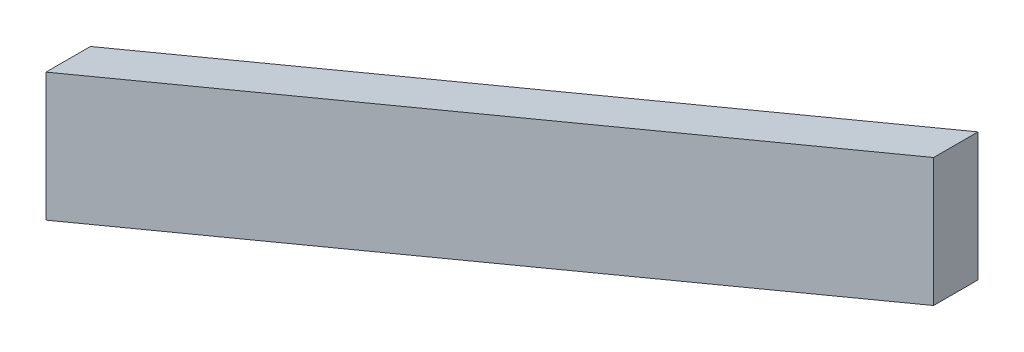
ISO-10303-21;
HEADER;
FILE_DESCRIPTION(('STEP AP214'),'2;1');
FILE_NAME('part.step','',(''),(''),'','','');
FILE_SCHEMA(('AUTOMOTIVE_DESIGN { 1 0 10303 214 1 1 1 1 }'));
ENDSEC;
DATA;
#1=APPLICATION_CONTEXT('core data for automotive mechanical design processes');
#2=APPLICATION_PROTOCOL_DEFINITION('international standard','automotive_design',2000,#1);
#3=PRODUCT_CONTEXT('',#1,'mechanical');
#4=PRODUCT('Part','Part','',(#3));
#5=PRODUCT_RELATED_PRODUCT_CATEGORY('part','',(#4));
#6=PRODUCT_DEFINITION_FORMATION('','',#4);
#7=PRODUCT_DEFINITION_CONTEXT('part definition',#1,'design');
#8=PRODUCT_DEFINITION('design','',#6,#7);
#9=PRODUCT_DEFINITION_SHAPE('','',#8);
#10=(LENGTH_UNIT() NAMED_UNIT(*) SI_UNIT(.MILLI.,.METRE.));
#11=(NAMED_UNIT(*) PLANE_ANGLE_UNIT() SI_UNIT($,.RADIAN.));
#12=(NAMED_UNIT(*) SI_UNIT($,.STERADIAN.) SOLID_ANGLE_UNIT());
#13=UNCERTAINTY_MEASURE_WITH_UNIT(LENGTH_MEASURE(1.E-05),#10,'distance_accuracy_value','');
#14=(GEOMETRIC_REPRESENTATION_CONTEXT(3) GLOBAL_UNCERTAINTY_ASSIGNED_CONTEXT((#13)) GLOBAL_UNIT_ASSIGNED_CONTEXT((#10,
#11,#12)) REPRESENTATION_CONTEXT('',''));
#15=CARTESIAN_POINT('',(0.,0.,0.));
#16=DIRECTION('',(0.,0.,1.));
#17=DIRECTION('',(1.,0.,0.));
#18=AXIS2_PLACEMENT_3D('',#15,#16,#17);
#19=CARTESIAN_POINT('',(0.,136.666666666667,30.));
#20=DIRECTION('',(1.,0.,0.));
#21=DIRECTION('',(0.,1.,0.));
#22=AXIS2_PLACEMENT_3D('',#19,#20,#21);
#23=PLANE('',#22);
#24=DIRECTION('',(0.,-1.,0.));
#25=VECTOR('',#24,1.);
#26=CARTESIAN_POINT('',(0.,136.666666666667,0.));
#27=LINE('',#26,#25);
#28=CARTESIAN_POINT('',(0.,136.666666666667,0.));
#29=VERTEX_POINT('',#28);
#30=CARTESIAN_POINT('',(0.,50.,0.));
#31=VERTEX_POINT('',#30);
#32=EDGE_CURVE('E101',#29,#31,#27,.T.);
#33=ORIENTED_EDGE('',*,*,#32,.T.);
#34=DIRECTION('',(0.,0.,-1.));
#35=VECTOR('',#34,1.);
#36=CARTESIAN_POINT('',(0.,50.,30.));
#37=LINE('',#36,#35);
#38=CARTESIAN_POINT('',(0.,50.,30.));
#39=VERTEX_POINT('',#38);
#40=EDGE_CURVE('E11',#39,#31,#37,.T.);
#41=ORIENTED_EDGE('',*,*,#40,.F.);
#42=DIRECTION('',(0.,-1.,0.));
#43=VECTOR('',#42,1.);
#44=CARTESIAN_POINT('',(0.,136.666666666667,30.));
#45=LINE('',#44,#43);
#46=CARTESIAN_POINT('',(0.,136.666666666667,30.));
#47=VERTEX_POINT('',#46);
#48=EDGE_CURVE('E88',#47,#39,#45,.T.);
#49=ORIENTED_EDGE('',*,*,#48,.F.);
#50=DIRECTION('',(0.,0.,-1.));
#51=VECTOR('',#50,1.);
#52=CARTESIAN_POINT('',(0.,136.666666666667,30.));
#53=LINE('',#52,#51);
#54=EDGE_CURVE('E97',#47,#29,#53,.T.);
#55=ORIENTED_EDGE('',*,*,#54,.T.);
#56=EDGE_LOOP('',(#33,#41,#49,#55));
#57=FACE_BOUND('',#56,.T.);
#58=ADVANCED_FACE('F35',(#57),#23,.F.);
#59=CARTESIAN_POINT('',(0.,50.,30.));
#60=DIRECTION('',(-0.384615384615385,0.923076923076923,0.));
#61=DIRECTION('',(-0.923076923076923,-0.384615384615385,0.));
#62=AXIS2_PLACEMENT_3D('',#59,#60,#61);
#63=PLANE('',#62);
#64=CARTESIAN_POINT('',(79.5415520947155,83.1423133727981,15.5103204812637));
#65=DIRECTION('',(-0.384615384615385,0.923076923076923,0.));
#66=DIRECTION('',(-0.923076923076923,-0.384615384615385,0.));
#67=AXIS2_PLACEMENT_3D('',#64,#65,#66);
#68=ELLIPSE('',#67,10.8333333333333,9.99999999999997);
#69=CARTESIAN_POINT('',(69.5415520947155,78.9756467061315,15.5103204812637));
#70=VERTEX_POINT('',#69);
#71=EDGE_CURVE('E38',#70,#70,#68,.T.);
#72=ORIENTED_EDGE('',*,*,#71,.T.);
#73=EDGE_LOOP('',(#72));
#74=FACE_BOUND('',#73,.T.);
#75=CARTESIAN_POINT('',(225.493209735714,143.955504056548,15.5103204812637));
#76=DIRECTION('',(-0.384615384615385,0.923076923076923,0.));
#77=DIRECTION('',(-0.923076923076923,-0.384615384615385,0.));
#78=AXIS2_PLACEMENT_3D('',#75,#76,#77);
#79=ELLIPSE('',#78,10.8333333333333,9.99999999999998);
#80=CARTESIAN_POINT('',(215.493209735714,139.788837389881,15.5103204812637));
#81=VERTEX_POINT('',#80);
#82=EDGE_CURVE('E116',#81,#81,#79,.T.);
#83=ORIENTED_EDGE('',*,*,#82,.T.);
#84=EDGE_LOOP('',(#83));
#85=FACE_BOUND('',#84,.T.);
#86=CARTESIAN_POINT('',(367.872624007877,203.280260003282,15.5103204812637));
#87=DIRECTION('',(-0.384615384615385,0.923076923076923,0.));
#88=DIRECTION('',(-0.923076923076923,-0.384615384615385,0.));
#89=AXIS2_PLACEMENT_3D('',#86,#87,#88);
#90=ELLIPSE('',#89,10.8333333333333,9.99999999999998);
#91=CARTESIAN_POINT('',(357.872624007877,199.113593336615,15.5103204812637));
#92=VERTEX_POINT('',#91);
#93=EDGE_CURVE('E113',#92,#92,#90,.T.);
#94=ORIENTED_EDGE('',*,*,#93,.T.);
#95=EDGE_LOOP('',(#94));
#96=FACE_BOUND('',#95,.T.);
#97=CARTESIAN_POINT('',(492.901141917124,255.375475798802,15.5103204812637));
#98=DIRECTION('',(-0.384615384615385,0.923076923076923,0.));
#99=DIRECTION('',(-0.923076923076923,-0.384615384615385,0.));
#100=AXIS2_PLACEMENT_3D('',#97,#98,#99);
#101=ELLIPSE('',#100,10.8333333333333,9.99999999999995);
#102=CARTESIAN_POINT('',(482.901141917124,251.208809132135,15.5103204812637));
#103=VERTEX_POINT('',#102);
#104=EDGE_CURVE('E104',#103,#103,#101,.T.);
#105=ORIENTED_EDGE('',*,*,#104,.T.);
#106=EDGE_LOOP('',(#105));
#107=FACE_BOUND('',#106,.T.);
#108=DIRECTION('',(0.923076923076923,0.384615384615385,0.));
#109=VECTOR('',#108,1.);
#110=CARTESIAN_POINT('',(0.,50.,0.));
#111=LINE('',#110,#109);
#112=CARTESIAN_POINT('',(600.,300.,0.));
#113=VERTEX_POINT('',#112);
#114=EDGE_CURVE('E92',#31,#113,#111,.T.);
#115=ORIENTED_EDGE('',*,*,#114,.T.);
#116=DIRECTION('',(0.,0.,-1.));
#117=VECTOR('',#116,1.);
#118=CARTESIAN_POINT('',(600.,300.,30.));
#119=LINE('',#118,#117);
#120=CARTESIAN_POINT('',(600.,300.,30.));
#121=VERTEX_POINT('',#120);
#122=EDGE_CURVE('E44',#121,#113,#119,.T.);
#123=ORIENTED_EDGE('',*,*,#122,.F.);
#124=DIRECTION('',(0.923076923076923,0.384615384615385,0.));
#125=VECTOR('',#124,1.);
#126=CARTESIAN_POINT('',(0.,50.,30.));
#127=LINE('',#126,#125);
#128=EDGE_CURVE('E83',#39,#121,#127,.T.);
#129=ORIENTED_EDGE('',*,*,#128,.F.);
#130=ORIENTED_EDGE('',*,*,#40,.T.);
#131=EDGE_LOOP('',(#115,#123,#129,#130));
#132=FACE_BOUND('',#131,.T.);
#133=ADVANCED_FACE('F91',(#74,#85,#96,#107,#132),#63,.F.);
#134=CARTESIAN_POINT('',(600.,386.666666666667,30.));
#135=DIRECTION('',(-1.,0.,0.));
#136=DIRECTION('',(0.,0.,1.));
#137=AXIS2_PLACEMENT_3D('',#134,#135,#136);
#138=PLANE('',#137);
#139=DIRECTION('',(0.,1.,0.));
#140=VECTOR('',#139,1.);
#141=CARTESIAN_POINT('',(600.,386.666666666667,0.));
#142=LINE('',#141,#140);
#143=CARTESIAN_POINT('',(600.,386.666666666667,0.));
#144=VERTEX_POINT('',#143);
#145=EDGE_CURVE('E70',#113,#144,#142,.T.);
#146=ORIENTED_EDGE('',*,*,#145,.T.);
#147=DIRECTION('',(0.,0.,-1.));
#148=VECTOR('',#147,1.);
#149=CARTESIAN_POINT('',(600.,386.666666666667,30.));
#150=LINE('',#149,#148);
#151=CARTESIAN_POINT('',(600.,386.666666666667,30.));
#152=VERTEX_POINT('',#151);
#153=EDGE_CURVE('E93',#152,#144,#150,.T.);
#154=ORIENTED_EDGE('',*,*,#153,.F.);
#155=DIRECTION('',(0.,1.,0.));
#156=VECTOR('',#155,1.);
#157=CARTESIAN_POINT('',(600.,386.666666666667,30.));
#158=LINE('',#157,#156);
#159=EDGE_CURVE('E86',#121,#152,#158,.T.);
#160=ORIENTED_EDGE('',*,*,#159,.F.);
#161=ORIENTED_EDGE('',*,*,#122,.T.);
#162=EDGE_LOOP('',(#146,#154,#160,#161));
#163=FACE_BOUND('',#162,.T.);
#164=ADVANCED_FACE('F95',(#163),#138,.F.);
#165=CARTESIAN_POINT('',(0.,136.666666666667,30.));
#166=DIRECTION('',(0.384615384615385,-0.923076923076923,0.));
#167=DIRECTION('',(0.923076923076923,0.384615384615385,0.));
#168=AXIS2_PLACEMENT_3D('',#165,#166,#167);
#169=PLANE('',#168);
#170=DIRECTION('',(-0.923076923076923,-0.384615384615385,0.));
#171=VECTOR('',#170,1.);
#172=CARTESIAN_POINT('',(0.,136.666666666667,0.));
#173=LINE('',#172,#171);
#174=EDGE_CURVE('E76',#144,#29,#173,.T.);
#175=ORIENTED_EDGE('',*,*,#174,.T.);
#176=ORIENTED_EDGE('',*,*,#54,.F.);
#177=DIRECTION('',(-0.923076923076923,-0.384615384615385,0.));
#178=VECTOR('',#177,1.);
#179=CARTESIAN_POINT('',(0.,136.666666666667,30.));
#180=LINE('',#179,#178);
#181=EDGE_CURVE('E53',#152,#47,#180,.T.);
#182=ORIENTED_EDGE('',*,*,#181,.F.);
#183=ORIENTED_EDGE('',*,*,#153,.T.);
#184=EDGE_LOOP('',(#175,#176,#182,#183));
#185=FACE_BOUND('',#184,.T.);
#186=ADVANCED_FACE('F149',(#185),#169,.F.);
#187=CARTESIAN_POINT('',(0.,0.,30.));
#188=DIRECTION('',(0.,0.,1.));
#189=DIRECTION('',(1.,0.,0.));
#190=AXIS2_PLACEMENT_3D('',#187,#188,#189);
#191=PLANE('',#190);
#192=ORIENTED_EDGE('',*,*,#48,.T.);
#193=ORIENTED_EDGE('',*,*,#128,.T.);
#194=ORIENTED_EDGE('',*,*,#159,.T.);
#195=ORIENTED_EDGE('',*,*,#181,.T.);
#196=EDGE_LOOP('',(#192,#193,#194,#195));
#197=FACE_BOUND('',#196,.T.);
#198=ADVANCED_FACE('F84',(#197),#191,.T.);
#199=CARTESIAN_POINT('',(0.,0.,0.));
#200=DIRECTION('',(0.,0.,1.));
#201=DIRECTION('',(1.,0.,0.));
#202=AXIS2_PLACEMENT_3D('',#199,#200,#201);
#203=PLANE('',#202);
#204=ORIENTED_EDGE('',*,*,#32,.F.);
#205=ORIENTED_EDGE('',*,*,#174,.F.);
#206=ORIENTED_EDGE('',*,*,#145,.F.);
#207=ORIENTED_EDGE('',*,*,#114,.F.);
#208=EDGE_LOOP('',(#204,#205,#206,#207));
#209=FACE_BOUND('',#208,.T.);
#210=ADVANCED_FACE('F139',(#209),#203,.F.);
#211=CARTESIAN_POINT('',(492.901141917124,0.,15.5103204812637));
#212=DIRECTION('',(0.,-1.,0.));
#213=DIRECTION('',(0.,0.,-1.));
#214=AXIS2_PLACEMENT_3D('',#211,#212,#213);
#215=CYLINDRICAL_SURFACE('',#214,9.99999999999995);
#216=CARTESIAN_POINT('',(492.901141917124,292.042142465468,15.5103204812637));
#217=DIRECTION('',(0.,-1.,0.));
#218=DIRECTION('',(0.,0.,-1.));
#219=AXIS2_PLACEMENT_3D('',#216,#217,#218);
#220=CIRCLE('',#219,9.9999999999999);
#221=CARTESIAN_POINT('',(492.901141917124,292.042142465468,5.51032048126385));
#222=VERTEX_POINT('',#221);
#223=EDGE_CURVE('E112',#222,#222,#220,.T.);
#224=ORIENTED_EDGE('',*,*,#223,.F.);
#225=EDGE_LOOP('',(#224));
#226=FACE_BOUND('',#225,.T.);
#227=ORIENTED_EDGE('',*,*,#104,.F.);
#228=EDGE_LOOP('',(#227));
#229=FACE_BOUND('',#228,.T.);
#230=ADVANCED_FACE('F136',(#226,#229),#215,.F.);
#231=CARTESIAN_POINT('',(492.901141917124,292.042142465468,15.5103204812637));
#232=DIRECTION('',(0.,1.,0.));
#233=DIRECTION('',(0.,0.,1.));
#234=AXIS2_PLACEMENT_3D('',#231,#232,#233);
#235=PLANE('',#234);
#236=ORIENTED_EDGE('',*,*,#223,.T.);
#237=EDGE_LOOP('',(#236));
#238=FACE_BOUND('',#237,.T.);
#239=ADVANCED_FACE('F134',(#238),#235,.F.);
#240=CARTESIAN_POINT('',(367.872624007877,0.,15.5103204812637));
#241=DIRECTION('',(0.,-1.,0.));
#242=DIRECTION('',(0.,0.,-1.));
#243=AXIS2_PLACEMENT_3D('',#240,#241,#242);
#244=CYLINDRICAL_SURFACE('',#243,9.99999999999998);
#245=CARTESIAN_POINT('',(367.872624007877,239.946926669949,15.5103204812637));
#246=DIRECTION('',(0.,-1.,0.));
#247=DIRECTION('',(0.,0.,-1.));
#248=AXIS2_PLACEMENT_3D('',#245,#246,#247);
#249=CIRCLE('',#248,9.99999999999995);
#250=CARTESIAN_POINT('',(367.872624007877,239.946926669949,5.51032048126379));
#251=VERTEX_POINT('',#250);
#252=EDGE_CURVE('E115',#251,#251,#249,.T.);
#253=ORIENTED_EDGE('',*,*,#252,.F.);
#254=EDGE_LOOP('',(#253));
#255=FACE_BOUND('',#254,.T.);
#256=ORIENTED_EDGE('',*,*,#93,.F.);
#257=EDGE_LOOP('',(#256));
#258=FACE_BOUND('',#257,.T.);
#259=ADVANCED_FACE('F161',(#255,#258),#244,.F.);
#260=CARTESIAN_POINT('',(367.872624007877,239.946926669949,15.5103204812637));
#261=DIRECTION('',(0.,1.,0.));
#262=DIRECTION('',(0.,0.,1.));
#263=AXIS2_PLACEMENT_3D('',#260,#261,#262);
#264=PLANE('',#263);
#265=ORIENTED_EDGE('',*,*,#252,.T.);
#266=EDGE_LOOP('',(#265));
#267=FACE_BOUND('',#266,.T.);
#268=ADVANCED_FACE('F163',(#267),#264,.F.);
#269=CARTESIAN_POINT('',(225.493209735714,0.,15.5103204812637));
#270=DIRECTION('',(0.,-1.,0.));
#271=DIRECTION('',(0.,0.,-1.));
#272=AXIS2_PLACEMENT_3D('',#269,#270,#271);
#273=CYLINDRICAL_SURFACE('',#272,9.99999999999998);
#274=CARTESIAN_POINT('',(225.493209735714,180.622170723214,15.5103204812637));
#275=DIRECTION('',(0.,-1.,0.));
#276=DIRECTION('',(0.,0.,-1.));
#277=AXIS2_PLACEMENT_3D('',#274,#275,#276);
#278=CIRCLE('',#277,9.99999999999995);
#279=CARTESIAN_POINT('',(225.493209735714,180.622170723214,5.51032048126379));
#280=VERTEX_POINT('',#279);
#281=EDGE_CURVE('E118',#280,#280,#278,.T.);
#282=ORIENTED_EDGE('',*,*,#281,.F.);
#283=EDGE_LOOP('',(#282));
#284=FACE_BOUND('',#283,.T.);
#285=ORIENTED_EDGE('',*,*,#82,.F.);
#286=EDGE_LOOP('',(#285));
#287=FACE_BOUND('',#286,.T.);
#288=ADVANCED_FACE('F166',(#284,#287),#273,.F.);
#289=CARTESIAN_POINT('',(225.493209735714,180.622170723214,15.5103204812637));
#290=DIRECTION('',(0.,1.,0.));
#291=DIRECTION('',(0.,0.,1.));
#292=AXIS2_PLACEMENT_3D('',#289,#290,#291);
#293=PLANE('',#292);
#294=ORIENTED_EDGE('',*,*,#281,.T.);
#295=EDGE_LOOP('',(#294));
#296=FACE_BOUND('',#295,.T.);
#297=ADVANCED_FACE('F171',(#296),#293,.F.);
#298=CARTESIAN_POINT('',(79.5415520947155,0.,15.5103204812637));
#299=DIRECTION('',(0.,-1.,0.));
#300=DIRECTION('',(0.,0.,-1.));
#301=AXIS2_PLACEMENT_3D('',#298,#299,#300);
#302=CYLINDRICAL_SURFACE('',#301,9.99999999999997);
#303=CARTESIAN_POINT('',(79.5415520947155,119.808980039465,15.5103204812637));
#304=DIRECTION('',(0.,-1.,0.));
#305=DIRECTION('',(0.,0.,-1.));
#306=AXIS2_PLACEMENT_3D('',#303,#304,#305);
#307=CIRCLE('',#306,9.99999999999995);
#308=CARTESIAN_POINT('',(79.5415520947155,119.808980039465,5.51032048126379));
#309=VERTEX_POINT('',#308);
#310=EDGE_CURVE('E128',#309,#309,#307,.T.);
#311=ORIENTED_EDGE('',*,*,#310,.F.);
#312=EDGE_LOOP('',(#311));
#313=FACE_BOUND('',#312,.T.);
#314=ORIENTED_EDGE('',*,*,#71,.F.);
#315=EDGE_LOOP('',(#314));
#316=FACE_BOUND('',#315,.T.);
#317=ADVANCED_FACE('F174',(#313,#316),#302,.F.);
#318=CARTESIAN_POINT('',(79.5415520947155,119.808980039465,15.5103204812637));
#319=DIRECTION('',(0.,1.,0.));
#320=DIRECTION('',(0.,0.,1.));
#321=AXIS2_PLACEMENT_3D('',#318,#319,#320);
#322=PLANE('',#321);
#323=ORIENTED_EDGE('',*,*,#310,.T.);
#324=EDGE_LOOP('',(#323));
#325=FACE_BOUND('',#324,.T.);
#326=ADVANCED_FACE('F178',(#325),#322,.F.);
#327=CLOSED_SHELL('',(#58,#133,#164,#186,#198,#210,#230,#239,#259,#268,#288,#297,#317,#326));
#328=MANIFOLD_SOLID_BREP('B2',#327);
#329=ADVANCED_BREP_SHAPE_REPRESENTATION('',(#18,#328),#14);
#330=SHAPE_DEFINITION_REPRESENTATION(#9,#329);
ENDSEC;
END-ISO-10303-21;
